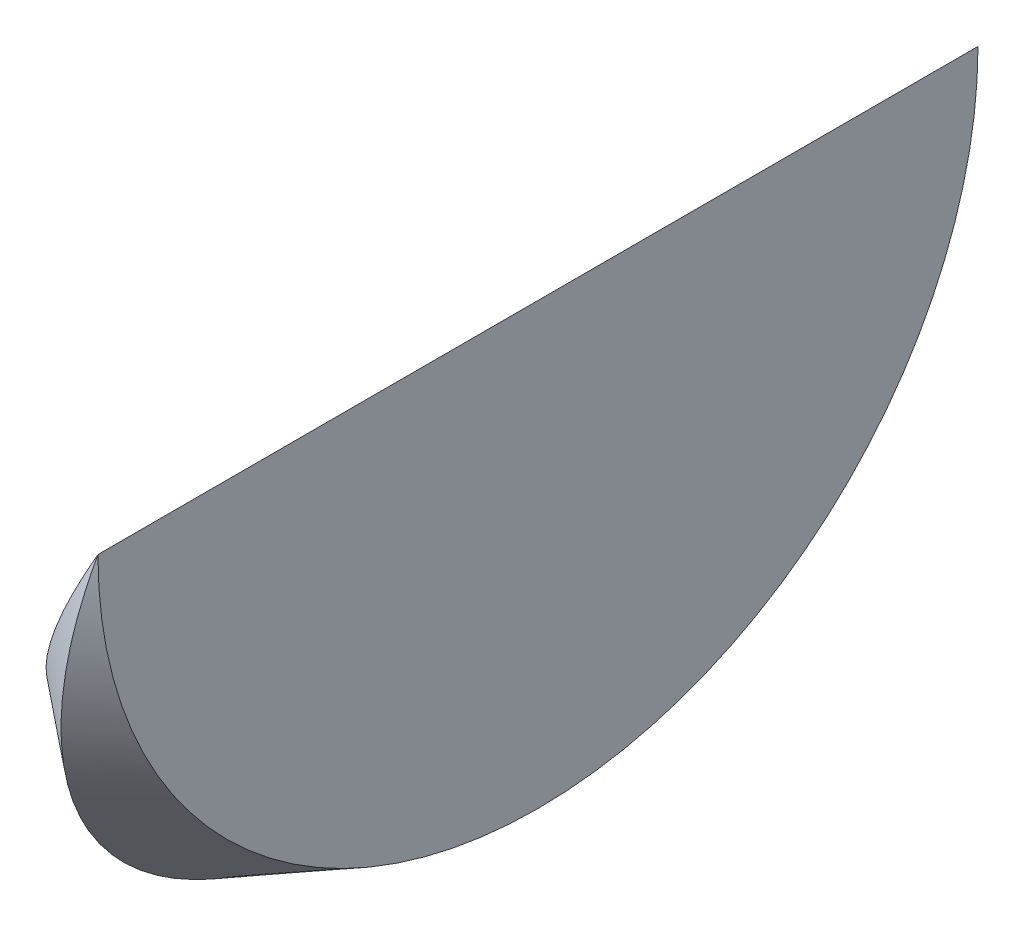
ISO-10303-21;
HEADER;
FILE_DESCRIPTION(('STEP AP214'),'2;1');
FILE_NAME('part.step','',(''),(''),'','','');
FILE_SCHEMA(('AUTOMOTIVE_DESIGN { 1 0 10303 214 1 1 1 1 }'));
ENDSEC;
DATA;
#1=APPLICATION_CONTEXT('core data for automotive mechanical design processes');
#2=APPLICATION_PROTOCOL_DEFINITION('international standard','automotive_design',2000,#1);
#3=PRODUCT_CONTEXT('',#1,'mechanical');
#4=PRODUCT('Part','Part','',(#3));
#5=PRODUCT_RELATED_PRODUCT_CATEGORY('part','',(#4));
#6=PRODUCT_DEFINITION_FORMATION('','',#4);
#7=PRODUCT_DEFINITION_CONTEXT('part definition',#1,'design');
#8=PRODUCT_DEFINITION('design','',#6,#7);
#9=PRODUCT_DEFINITION_SHAPE('','',#8);
#10=(LENGTH_UNIT() NAMED_UNIT(*) SI_UNIT(.MILLI.,.METRE.));
#11=(NAMED_UNIT(*) PLANE_ANGLE_UNIT() SI_UNIT($,.RADIAN.));
#12=(NAMED_UNIT(*) SI_UNIT($,.STERADIAN.) SOLID_ANGLE_UNIT());
#13=UNCERTAINTY_MEASURE_WITH_UNIT(LENGTH_MEASURE(1.E-05),#10,'distance_accuracy_value','');
#14=(GEOMETRIC_REPRESENTATION_CONTEXT(3) GLOBAL_UNCERTAINTY_ASSIGNED_CONTEXT((#13)) GLOBAL_UNIT_ASSIGNED_CONTEXT((#10,
#11,#12)) REPRESENTATION_CONTEXT('',''));
#15=CARTESIAN_POINT('',(0.,0.,0.));
#16=DIRECTION('',(0.,0.,1.));
#17=DIRECTION('',(1.,0.,0.));
#18=AXIS2_PLACEMENT_3D('',#15,#16,#17);
#19=CARTESIAN_POINT('',(0.556953504217827,0.0173478846927163,11.));
#20=DIRECTION('',(0.866025403784439,-0.5,0.));
#21=DIRECTION('',(0.,0.,-1.));
#22=AXIS2_PLACEMENT_3D('',#19,#20,#21);
#23=CONICAL_SURFACE('',#22,0.0553709682436748,0.478163557324296);
#24=CARTESIAN_POINT('',(0.587000921909422,0.,11.));
#25=DIRECTION('',(-0.866025403784439,0.5,0.));
#26=DIRECTION('',(-0.5,-0.866025403784439,0.));
#27=AXIS2_PLACEMENT_3D('',#24,#25,#26);
#28=CIRCLE('',#27,0.0733530529835337);
#29=CARTESIAN_POINT('',(0.587000921909422,0.,10.9266469470165));
#30=VERTEX_POINT('',#29);
#31=CARTESIAN_POINT('',(0.587000921909422,0.,11.0733530529835));
#32=VERTEX_POINT('',#31);
#33=EDGE_CURVE('E24',#30,#32,#28,.T.);
#34=ORIENTED_EDGE('',*,*,#33,.F.);
#35=CARTESIAN_POINT('',(0.601982810179768,0.0559131682182807,10.9657138945868));
#36=CARTESIAN_POINT('',(0.601496966338814,0.0540999743192921,10.9622696457282));
#37=CARTESIAN_POINT('',(0.60093847014691,0.052015638155273,10.9589820153032));
#38=CARTESIAN_POINT('',(0.599696067809433,0.0473789295083678,10.9527914998771));
#39=CARTESIAN_POINT('',(0.599012405460123,0.0448274668855204,10.9498878855124));
#40=CARTESIAN_POINT('',(0.597537656652963,0.0393236294087996,10.9445235246304));
#41=CARTESIAN_POINT('',(0.596746585998436,0.0363713135337253,10.9420627130858));
#42=CARTESIAN_POINT('',(0.595077267800914,0.0301413332065725,10.9376298235407));
#43=CARTESIAN_POINT('',(0.594198987259808,0.0268635456038652,10.93565793153));
#44=CARTESIAN_POINT('',(0.59232964230349,0.0198870552500124,10.9321516342427));
#45=CARTESIAN_POINT('',(0.591335103550748,0.0161753860946827,10.9306448582532));
#46=CARTESIAN_POINT('',(0.589297914675522,0.00857249370772809,10.9282394546613));
#47=CARTESIAN_POINT('',(0.588255255719946,0.0046812375105492,10.9273409391913));
#48=CARTESIAN_POINT('',(0.586112172302999,-0.00331685868635303,10.9261487267509));
#49=CARTESIAN_POINT('',(0.585010973215542,-0.00742658962999384,10.9258757297803));
#50=CARTESIAN_POINT('',(0.582810977148537,-0.0156370867285096,10.9260000676221));
#51=CARTESIAN_POINT('',(0.581712180741271,-0.0197378507476015,10.9263975477161));
#52=CARTESIAN_POINT('',(0.579468585908673,-0.028111060654455,10.9279072565039));
#53=CARTESIAN_POINT('',(0.578325920060247,-0.0323755476568541,10.9290673775067));
#54=CARTESIAN_POINT('',(0.576108175373614,-0.0406522835055843,10.9321229566669));
#55=CARTESIAN_POINT('',(0.57503310512005,-0.0446645003135925,10.9340185080058));
#56=CARTESIAN_POINT('',(0.572998894475018,-0.052256277794148,10.9384690328332));
#57=CARTESIAN_POINT('',(0.572038307313551,-0.0558412378858429,10.941014115005));
#58=CARTESIAN_POINT('',(0.570246932551028,-0.0625267395149737,10.946713732094));
#59=CARTESIAN_POINT('',(0.569416113847042,-0.0656273971301263,10.9498681205658));
#60=CARTESIAN_POINT('',(0.567942003230337,-0.0711288528476495,10.9565716948777));
#61=CARTESIAN_POINT('',(0.567292835572019,-0.0735515795311226,10.9601015802428));
#62=CARTESIAN_POINT('',(0.566165323706198,-0.0777595111005014,10.9675476713373));
#63=CARTESIAN_POINT('',(0.565686932691213,-0.0795448906743097,10.9714637708347));
#64=CARTESIAN_POINT('',(0.564935963576708,-0.0823475455645574,10.9793872580977));
#65=CARTESIAN_POINT('',(0.564655343847375,-0.0833948326520354,10.9833832803545));
#66=CARTESIAN_POINT('',(0.564277487840652,-0.0848050104670719,10.9915025625088));
#67=CARTESIAN_POINT('',(0.564180214735057,-0.0851680386393619,10.9956257966845));
#68=CARTESIAN_POINT('',(0.564172769464685,-0.0851958247666656,11.0037556249445));
#69=CARTESIAN_POINT('',(0.564257295922216,-0.0848803677325762,11.0077621625759));
#70=CARTESIAN_POINT('',(0.564599633562562,-0.0836027462654619,11.0156628265874));
#71=CARTESIAN_POINT('',(0.564857436903437,-0.0826406110989553,11.0195569580463));
#72=CARTESIAN_POINT('',(0.565536720217243,-0.0801054912590997,11.0271183366966));
#73=CARTESIAN_POINT('',(0.565957936803748,-0.0785334895572712,11.0307859380335));
#74=CARTESIAN_POINT('',(0.566949998436751,-0.0748310651386615,11.0378050842205));
#75=CARTESIAN_POINT('',(0.567520859711654,-0.0727005818566492,11.0411565947381));
#76=CARTESIAN_POINT('',(0.568810400240536,-0.0678879510844428,11.0475410856725));
#77=CARTESIAN_POINT('',(0.569532436512336,-0.0651932750331774,11.0505639331955));
#78=CARTESIAN_POINT('',(0.571092923177138,-0.0593694595156029,11.0561205512031));
#79=CARTESIAN_POINT('',(0.571931383264098,-0.0562402838709494,11.0586542809196));
#80=CARTESIAN_POINT('',(0.573737157612832,-0.0495010422544701,11.0632708706618));
#81=CARTESIAN_POINT('',(0.574708321625399,-0.0458766088170883,11.0653312450393));
#82=CARTESIAN_POINT('',(0.576724402833634,-0.0383524913157711,11.0688217785963));
#83=CARTESIAN_POINT('',(0.577769373633759,-0.0344526071972765,11.0702514741505));
#84=CARTESIAN_POINT('',(0.579948472619475,-0.0263200990678636,11.0724962519831));
#85=CARTESIAN_POINT('',(0.581084499559213,-0.0220803888099933,11.073283753278));
#86=CARTESIAN_POINT('',(0.583372728256007,-0.0135406030542234,11.0741263577704));
#87=CARTESIAN_POINT('',(0.584524889245029,-0.00924067970469369,11.0741830575812));
#88=CARTESIAN_POINT('',(0.586181609626787,-0.00305771506603785,11.073738885184));
#89=CARTESIAN_POINT('',(0.586692491933798,-0.00115107633958221,11.0735285835195));
#90=CARTESIAN_POINT('',(0.588230352425399,0.0045882971500268,11.0726726187141));
#91=CARTESIAN_POINT('',(0.589249729587881,0.00839266451248502,11.0718016594322));
#92=CARTESIAN_POINT('',(0.591244890506974,0.0158387064318156,11.0694764133018));
#93=CARTESIAN_POINT('',(0.592220568181996,0.0194799850868079,11.0680207843179));
#94=CARTESIAN_POINT('',(0.594214278407367,0.0269206129434622,11.0643450122851));
#95=CARTESIAN_POINT('',(0.595223791304731,0.0306881663673196,11.062055077148));
#96=CARTESIAN_POINT('',(0.597125204334662,0.0377843364011951,11.0568338562246));
#97=CARTESIAN_POINT('',(0.598017056244821,0.0411127730427361,11.0539023087794));
#98=CARTESIAN_POINT('',(0.598833558077456,0.0441599993666051,11.0506802033875));
#99=B_SPLINE_CURVE_WITH_KNOTS('',3,(#35,#36,#37,#38,#39,#40,#41,#42,#43,#44,#45,#46,#47,#48,#49,
#50,#51,#52,#53,#54,#55,#56,#57,#58,#59,#60,#61,#62,#63,#64,#65,#66,#67,#68,#69,#70,#71,#72,#73,
#74,#75,#76,#77,#78,#79,#80,#81,#82,#83,#84,#85,#86,#87,#88,#89,#90,#91,#92,#93,#94,#95,#96,#97,
#98),.UNSPECIFIED.,.F.,.F.,(4,2,2,2,2,2,2,2,2,2,2,2,2,2,2,2,2,2,2,2,2,2,2,2,2,2,2,2,2,2,2,4),
(0.,0.0117504198016468,0.0234781912567788,0.0352042390341439,0.046934740694891,
0.0592669585877348,0.0716014492951973,0.0843385651584168,0.0970784413028256,0.11070638971937,
0.124336065404428,0.137769424583145,0.151199559094499,0.164124793952959,0.177046483460928,
0.189406551347766,0.20176413624565,0.21376626165805,0.225767843930427,0.237750162107627,
0.24973378026022,0.262018834529255,0.274304912319939,0.287089876718541,0.299884224015663,
0.313202764028174,0.326492201513118,0.332444058583361,0.344494928104463,0.356573620494738,
0.370073231655912,0.383578358449345),.UNSPECIFIED.);
#100=EDGE_CURVE('E39',#30,#32,#99,.T.);
#101=ORIENTED_EDGE('',*,*,#100,.T.);
#102=EDGE_LOOP('',(#34,#101));
#103=FACE_BOUND('',#102,.T.);
#104=ADVANCED_FACE('F15',(#103),#23,.T.);
#105=CARTESIAN_POINT('',(0.587000921909422,0.,11.));
#106=DIRECTION('',(-0.866025403784439,0.5,0.));
#107=DIRECTION('',(-0.5,-0.866025403784439,0.));
#108=AXIS2_PLACEMENT_3D('',#105,#106,#107);
#109=PLANE('',#108);
#110=ORIENTED_EDGE('',*,*,#33,.T.);
#111=DIRECTION('',(0.,0.,-1.));
#112=VECTOR('',#111,1.);
#113=CARTESIAN_POINT('',(0.587000921909422,0.,11.));
#114=LINE('',#113,#112);
#115=EDGE_CURVE('E9',#32,#30,#114,.T.);
#116=ORIENTED_EDGE('',*,*,#115,.T.);
#117=EDGE_LOOP('',(#110,#116));
#118=FACE_BOUND('',#117,.T.);
#119=ADVANCED_FACE('F17',(#118),#109,.T.);
#120=CARTESIAN_POINT('',(0.621696691294812,0.,11.));
#121=DIRECTION('',(-1.,0.,0.));
#122=DIRECTION('',(0.,0.,-1.));
#123=AXIS2_PLACEMENT_3D('',#120,#121,#122);
#124=CONICAL_SURFACE('',#123,0.0553709682436748,0.478163557324296);
#125=ORIENTED_EDGE('',*,*,#100,.F.);
#126=CARTESIAN_POINT('',(0.587000921909422,0.,11.));
#127=DIRECTION('',(1.,0.,0.));
#128=DIRECTION('',(0.,1.,0.));
#129=AXIS2_PLACEMENT_3D('',#126,#127,#128);
#130=CIRCLE('',#129,0.0733530529835337);
#131=EDGE_CURVE('E30',#32,#30,#130,.T.);
#132=ORIENTED_EDGE('',*,*,#131,.F.);
#133=EDGE_LOOP('',(#125,#132));
#134=FACE_BOUND('',#133,.T.);
#135=ADVANCED_FACE('F38',(#134),#124,.T.);
#136=CARTESIAN_POINT('',(0.587000921909422,0.,11.));
#137=DIRECTION('',(1.,0.,0.));
#138=DIRECTION('',(0.,1.,0.));
#139=AXIS2_PLACEMENT_3D('',#136,#137,#138);
#140=PLANE('',#139);
#141=ORIENTED_EDGE('',*,*,#115,.F.);
#142=ORIENTED_EDGE('',*,*,#131,.T.);
#143=EDGE_LOOP('',(#141,#142));
#144=FACE_BOUND('',#143,.T.);
#145=ADVANCED_FACE('F32',(#144),#140,.T.);
#146=CLOSED_SHELL('',(#104,#119,#135,#145));
#147=MANIFOLD_SOLID_BREP('B1',#146);
#148=ADVANCED_BREP_SHAPE_REPRESENTATION('',(#18,#147),#14);
#149=SHAPE_DEFINITION_REPRESENTATION(#9,#148);
ENDSEC;
END-ISO-10303-21;
